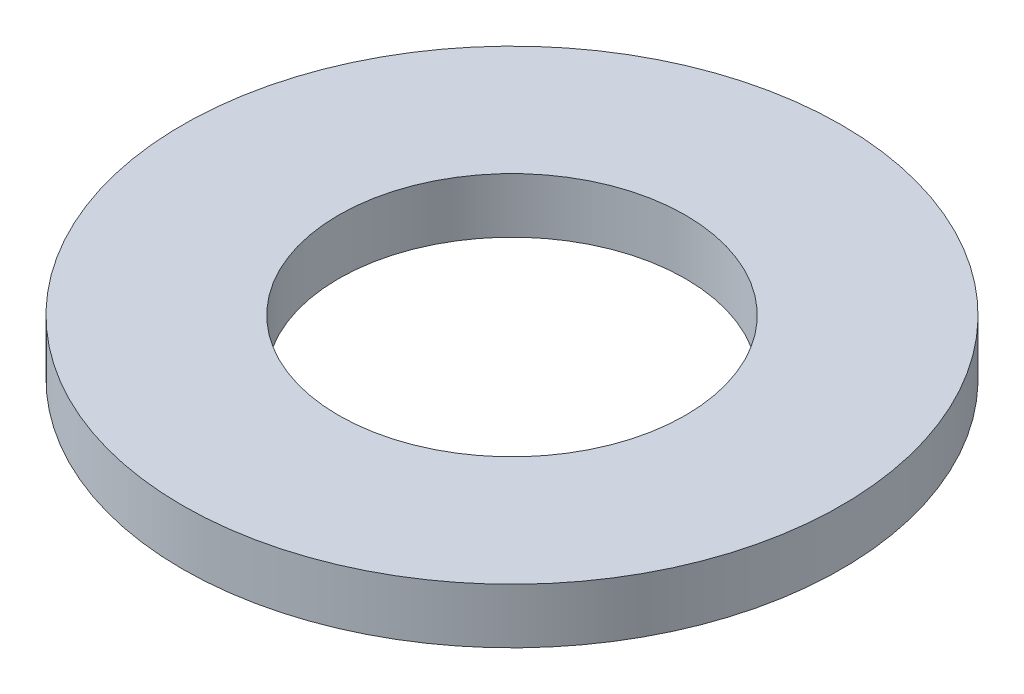
ISO-10303-21;
HEADER;
FILE_DESCRIPTION(('STEP AP214'),'2;1');
FILE_NAME('part.step','',(''),(''),'','','');
FILE_SCHEMA(('AUTOMOTIVE_DESIGN { 1 0 10303 214 1 1 1 1 }'));
ENDSEC;
DATA;
#1=APPLICATION_CONTEXT('core data for automotive mechanical design processes');
#2=APPLICATION_PROTOCOL_DEFINITION('international standard','automotive_design',2000,#1);
#3=PRODUCT_CONTEXT('',#1,'mechanical');
#4=PRODUCT('Part','Part','',(#3));
#5=PRODUCT_RELATED_PRODUCT_CATEGORY('part','',(#4));
#6=PRODUCT_DEFINITION_FORMATION('','',#4);
#7=PRODUCT_DEFINITION_CONTEXT('part definition',#1,'design');
#8=PRODUCT_DEFINITION('design','',#6,#7);
#9=PRODUCT_DEFINITION_SHAPE('','',#8);
#10=(LENGTH_UNIT() NAMED_UNIT(*) SI_UNIT(.MILLI.,.METRE.));
#11=(NAMED_UNIT(*) PLANE_ANGLE_UNIT() SI_UNIT($,.RADIAN.));
#12=(NAMED_UNIT(*) SI_UNIT($,.STERADIAN.) SOLID_ANGLE_UNIT());
#13=UNCERTAINTY_MEASURE_WITH_UNIT(LENGTH_MEASURE(1.E-05),#10,'distance_accuracy_value','');
#14=(GEOMETRIC_REPRESENTATION_CONTEXT(3) GLOBAL_UNCERTAINTY_ASSIGNED_CONTEXT((#13)) GLOBAL_UNIT_ASSIGNED_CONTEXT((#10,
#11,#12)) REPRESENTATION_CONTEXT('',''));
#15=CARTESIAN_POINT('',(0.,0.,0.));
#16=DIRECTION('',(0.,0.,1.));
#17=DIRECTION('',(1.,0.,0.));
#18=AXIS2_PLACEMENT_3D('',#15,#16,#17);
#19=CARTESIAN_POINT('',(0.,6.35,0.));
#20=DIRECTION('',(0.,1.,0.));
#21=DIRECTION('',(0.,0.,1.));
#22=AXIS2_PLACEMENT_3D('',#19,#20,#21);
#23=PLANE('',#22);
#24=CARTESIAN_POINT('',(0.,6.35,0.));
#25=DIRECTION('',(0.,1.,0.));
#26=DIRECTION('',(0.,0.,1.));
#27=AXIS2_PLACEMENT_3D('',#24,#25,#26);
#28=CIRCLE('',#27,38.);
#29=CARTESIAN_POINT('',(0.,6.35,38.));
#30=VERTEX_POINT('',#29);
#31=EDGE_CURVE('E10',#30,#30,#28,.T.);
#32=ORIENTED_EDGE('',*,*,#31,.T.);
#33=EDGE_LOOP('',(#32));
#34=FACE_BOUND('',#33,.T.);
#35=CARTESIAN_POINT('',(0.,6.35,0.));
#36=DIRECTION('',(0.,1.,0.));
#37=DIRECTION('',(0.,0.,1.));
#38=AXIS2_PLACEMENT_3D('',#35,#36,#37);
#39=CIRCLE('',#38,20.);
#40=CARTESIAN_POINT('',(0.,6.35,20.));
#41=VERTEX_POINT('',#40);
#42=EDGE_CURVE('E53',#41,#41,#39,.T.);
#43=ORIENTED_EDGE('',*,*,#42,.F.);
#44=EDGE_LOOP('',(#43));
#45=FACE_BOUND('',#44,.T.);
#46=ADVANCED_FACE('F42',(#34,#45),#23,.T.);
#47=CARTESIAN_POINT('',(0.,0.,0.));
#48=DIRECTION('',(0.,1.,0.));
#49=DIRECTION('',(0.,0.,1.));
#50=AXIS2_PLACEMENT_3D('',#47,#48,#49);
#51=PLANE('',#50);
#52=CARTESIAN_POINT('',(0.,0.,0.));
#53=DIRECTION('',(0.,1.,0.));
#54=DIRECTION('',(0.,0.,1.));
#55=AXIS2_PLACEMENT_3D('',#52,#53,#54);
#56=CIRCLE('',#55,38.);
#57=CARTESIAN_POINT('',(0.,0.,38.));
#58=VERTEX_POINT('',#57);
#59=EDGE_CURVE('E46',#58,#58,#56,.T.);
#60=ORIENTED_EDGE('',*,*,#59,.F.);
#61=EDGE_LOOP('',(#60));
#62=FACE_BOUND('',#61,.T.);
#63=CARTESIAN_POINT('',(0.,0.,0.));
#64=DIRECTION('',(0.,1.,0.));
#65=DIRECTION('',(0.,0.,1.));
#66=AXIS2_PLACEMENT_3D('',#63,#64,#65);
#67=CIRCLE('',#66,20.);
#68=CARTESIAN_POINT('',(0.,0.,20.));
#69=VERTEX_POINT('',#68);
#70=EDGE_CURVE('E55',#69,#69,#67,.T.);
#71=ORIENTED_EDGE('',*,*,#70,.T.);
#72=EDGE_LOOP('',(#71));
#73=FACE_BOUND('',#72,.T.);
#74=ADVANCED_FACE('F65',(#62,#73),#51,.F.);
#75=CARTESIAN_POINT('',(0.,6.35,0.));
#76=DIRECTION('',(0.,-1.,0.));
#77=DIRECTION('',(0.,0.,-1.));
#78=AXIS2_PLACEMENT_3D('',#75,#76,#77);
#79=CYLINDRICAL_SURFACE('',#78,38.);
#80=ORIENTED_EDGE('',*,*,#31,.F.);
#81=EDGE_LOOP('',(#80));
#82=FACE_BOUND('',#81,.T.);
#83=ORIENTED_EDGE('',*,*,#59,.T.);
#84=EDGE_LOOP('',(#83));
#85=FACE_BOUND('',#84,.T.);
#86=ADVANCED_FACE('F44',(#82,#85),#79,.T.);
#87=CARTESIAN_POINT('',(0.,6.35,0.));
#88=DIRECTION('',(0.,-1.,0.));
#89=DIRECTION('',(0.,0.,-1.));
#90=AXIS2_PLACEMENT_3D('',#87,#88,#89);
#91=CYLINDRICAL_SURFACE('',#90,20.);
#92=ORIENTED_EDGE('',*,*,#42,.T.);
#93=EDGE_LOOP('',(#92));
#94=FACE_BOUND('',#93,.T.);
#95=ORIENTED_EDGE('',*,*,#70,.F.);
#96=EDGE_LOOP('',(#95));
#97=FACE_BOUND('',#96,.T.);
#98=ADVANCED_FACE('F61',(#94,#97),#91,.F.);
#99=CLOSED_SHELL('',(#46,#74,#86,#98));
#100=MANIFOLD_SOLID_BREP('B2',#99);
#101=ADVANCED_BREP_SHAPE_REPRESENTATION('',(#18,#100),#14);
#102=SHAPE_DEFINITION_REPRESENTATION(#9,#101);
ENDSEC;
END-ISO-10303-21;
